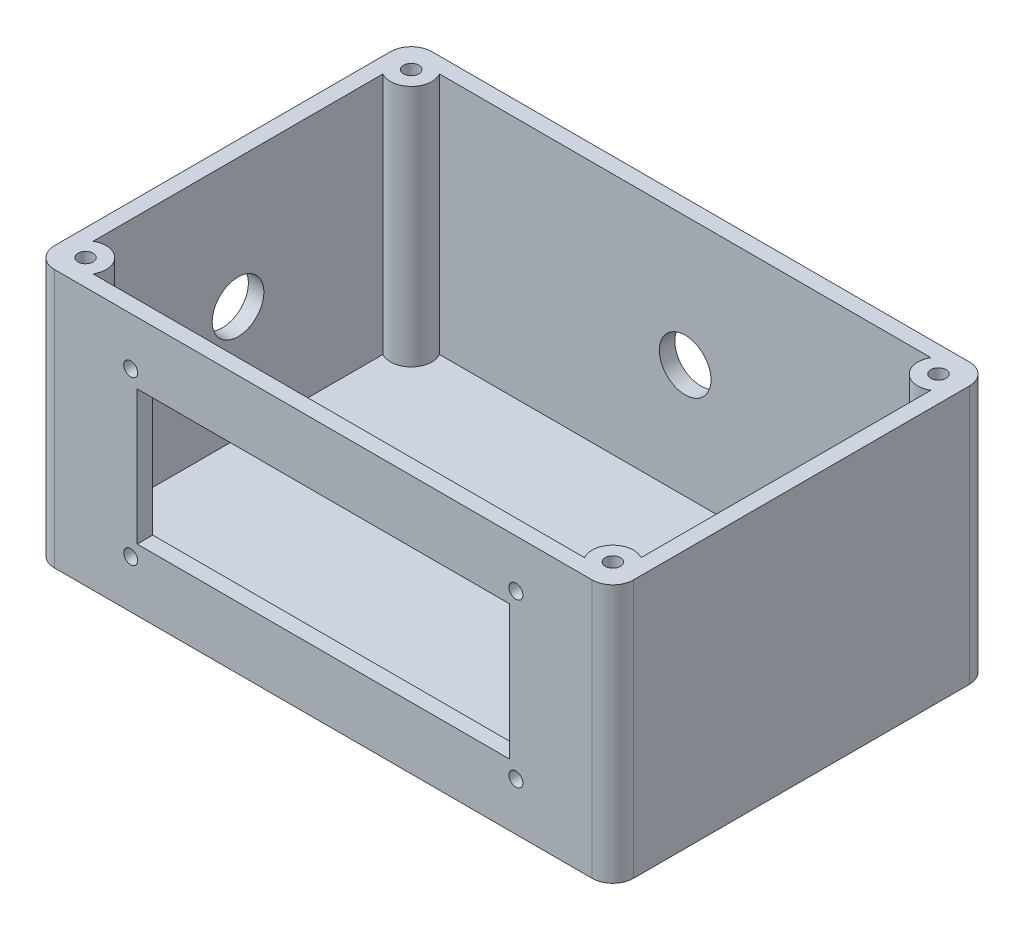
ISO-10303-21;
HEADER;
FILE_DESCRIPTION(('STEP AP214'),'2;1');
FILE_NAME('part.step','',(''),(''),'','','');
FILE_SCHEMA(('AUTOMOTIVE_DESIGN { 1 0 10303 214 1 1 1 1 }'));
ENDSEC;
DATA;
#1=APPLICATION_CONTEXT('core data for automotive mechanical design processes');
#2=APPLICATION_PROTOCOL_DEFINITION('international standard','automotive_design',2000,#1);
#3=PRODUCT_CONTEXT('',#1,'mechanical');
#4=PRODUCT('Part','Part','',(#3));
#5=PRODUCT_RELATED_PRODUCT_CATEGORY('part','',(#4));
#6=PRODUCT_DEFINITION_FORMATION('','',#4);
#7=PRODUCT_DEFINITION_CONTEXT('part definition',#1,'design');
#8=PRODUCT_DEFINITION('design','',#6,#7);
#9=PRODUCT_DEFINITION_SHAPE('','',#8);
#10=(LENGTH_UNIT() NAMED_UNIT(*) SI_UNIT(.MILLI.,.METRE.));
#11=(NAMED_UNIT(*) PLANE_ANGLE_UNIT() SI_UNIT($,.RADIAN.));
#12=(NAMED_UNIT(*) SI_UNIT($,.STERADIAN.) SOLID_ANGLE_UNIT());
#13=UNCERTAINTY_MEASURE_WITH_UNIT(LENGTH_MEASURE(1.E-05),#10,'distance_accuracy_value','');
#14=(GEOMETRIC_REPRESENTATION_CONTEXT(3) GLOBAL_UNCERTAINTY_ASSIGNED_CONTEXT((#13)) GLOBAL_UNIT_ASSIGNED_CONTEXT((#10,
#11,#12)) REPRESENTATION_CONTEXT('',''));
#15=CARTESIAN_POINT('',(0.,0.,0.));
#16=DIRECTION('',(0.,0.,1.));
#17=DIRECTION('',(1.,0.,0.));
#18=AXIS2_PLACEMENT_3D('',#15,#16,#17);
#19=CARTESIAN_POINT('',(53.,50.,-36.5));
#20=DIRECTION('',(-1.,0.,0.));
#21=DIRECTION('',(0.,0.,1.));
#22=AXIS2_PLACEMENT_3D('',#19,#20,#21);
#23=PLANE('',#22);
#24=DIRECTION('',(0.,0.,-1.));
#25=VECTOR('',#24,1.);
#26=CARTESIAN_POINT('',(53.,3.,-36.5));
#27=LINE('',#26,#25);
#28=CARTESIAN_POINT('',(53.,3.,28.0358983848622));
#29=VERTEX_POINT('',#28);
#30=CARTESIAN_POINT('',(53.,3.,-28.0358983848623));
#31=VERTEX_POINT('',#30);
#32=EDGE_CURVE('E278',#29,#31,#27,.T.);
#33=ORIENTED_EDGE('',*,*,#32,.F.);
#34=DIRECTION('',(0.,-1.,0.));
#35=VECTOR('',#34,1.);
#36=CARTESIAN_POINT('',(53.,50.,28.0358983848622));
#37=LINE('',#36,#35);
#38=CARTESIAN_POINT('',(53.,50.,28.0358983848622));
#39=VERTEX_POINT('',#38);
#40=EDGE_CURVE('E238',#29,#39,#37,.F.);
#41=ORIENTED_EDGE('',*,*,#40,.T.);
#42=DIRECTION('',(0.,0.,-1.));
#43=VECTOR('',#42,1.);
#44=CARTESIAN_POINT('',(53.,50.,-36.5));
#45=LINE('',#44,#43);
#46=CARTESIAN_POINT('',(53.,50.,-28.0358983848623));
#47=VERTEX_POINT('',#46);
#48=EDGE_CURVE('E292',#39,#47,#45,.T.);
#49=ORIENTED_EDGE('',*,*,#48,.T.);
#50=DIRECTION('',(0.,-1.,0.));
#51=VECTOR('',#50,1.);
#52=CARTESIAN_POINT('',(53.,50.,-28.0358983848623));
#53=LINE('',#52,#51);
#54=EDGE_CURVE('E246',#47,#31,#53,.T.);
#55=ORIENTED_EDGE('',*,*,#54,.T.);
#56=EDGE_LOOP('',(#33,#41,#49,#55));
#57=FACE_BOUND('',#56,.T.);
#58=ADVANCED_FACE('F38',(#57),#23,.T.);
#59=CARTESIAN_POINT('',(-56.,50.,33.5));
#60=DIRECTION('',(0.,0.,-1.));
#61=DIRECTION('',(-1.,0.,0.));
#62=AXIS2_PLACEMENT_3D('',#59,#60,#61);
#63=PLANE('',#62);
#64=CARTESIAN_POINT('',(-37.26,9.26000000000001,33.5));
#65=DIRECTION('',(0.,0.,-1.));
#66=DIRECTION('',(-1.,0.,0.));
#67=AXIS2_PLACEMENT_3D('',#64,#65,#66);
#68=CIRCLE('',#67,1.35);
#69=CARTESIAN_POINT('',(-38.61,9.26000000000001,33.5));
#70=VERTEX_POINT('',#69);
#71=EDGE_CURVE('E804',#70,#70,#68,.F.);
#72=ORIENTED_EDGE('',*,*,#71,.T.);
#73=EDGE_LOOP('',(#72));
#74=FACE_BOUND('',#73,.T.);
#75=CARTESIAN_POINT('',(37.26,40.74,33.5));
#76=DIRECTION('',(0.,0.,-1.));
#77=DIRECTION('',(-1.,0.,0.));
#78=AXIS2_PLACEMENT_3D('',#75,#76,#77);
#79=CIRCLE('',#78,1.35);
#80=CARTESIAN_POINT('',(35.91,40.74,33.5));
#81=VERTEX_POINT('',#80);
#82=EDGE_CURVE('E803',#81,#81,#79,.F.);
#83=ORIENTED_EDGE('',*,*,#82,.T.);
#84=EDGE_LOOP('',(#83));
#85=FACE_BOUND('',#84,.T.);
#86=CARTESIAN_POINT('',(37.26,9.26000000000001,33.5));
#87=DIRECTION('',(0.,0.,-1.));
#88=DIRECTION('',(-1.,0.,0.));
#89=AXIS2_PLACEMENT_3D('',#86,#87,#88);
#90=CIRCLE('',#89,1.35);
#91=CARTESIAN_POINT('',(35.91,9.26000000000001,33.5));
#92=VERTEX_POINT('',#91);
#93=EDGE_CURVE('E794',#92,#92,#90,.F.);
#94=ORIENTED_EDGE('',*,*,#93,.T.);
#95=EDGE_LOOP('',(#94));
#96=FACE_BOUND('',#95,.T.);
#97=CARTESIAN_POINT('',(-37.26,40.74,33.5));
#98=DIRECTION('',(0.,0.,-1.));
#99=DIRECTION('',(-1.,0.,0.));
#100=AXIS2_PLACEMENT_3D('',#97,#98,#99);
#101=CIRCLE('',#100,1.35);
#102=CARTESIAN_POINT('',(-38.61,40.74,33.5));
#103=VERTEX_POINT('',#102);
#104=EDGE_CURVE('E813',#103,#103,#101,.F.);
#105=ORIENTED_EDGE('',*,*,#104,.T.);
#106=EDGE_LOOP('',(#105));
#107=FACE_BOUND('',#106,.T.);
#108=DIRECTION('',(0.,1.,0.));
#109=VECTOR('',#108,1.);
#110=CARTESIAN_POINT('',(36.,38.,33.5));
#111=LINE('',#110,#109);
#112=CARTESIAN_POINT('',(36.,12.,33.5));
#113=VERTEX_POINT('',#112);
#114=CARTESIAN_POINT('',(36.,38.,33.5));
#115=VERTEX_POINT('',#114);
#116=EDGE_CURVE('E185',#113,#115,#111,.T.);
#117=ORIENTED_EDGE('',*,*,#116,.T.);
#118=DIRECTION('',(-1.,0.,0.));
#119=VECTOR('',#118,1.);
#120=CARTESIAN_POINT('',(-36.,38.,33.5));
#121=LINE('',#120,#119);
#122=CARTESIAN_POINT('',(-36.,38.,33.5));
#123=VERTEX_POINT('',#122);
#124=EDGE_CURVE('E214',#115,#123,#121,.T.);
#125=ORIENTED_EDGE('',*,*,#124,.T.);
#126=DIRECTION('',(0.,-1.,0.));
#127=VECTOR('',#126,1.);
#128=CARTESIAN_POINT('',(-36.,38.,33.5));
#129=LINE('',#128,#127);
#130=CARTESIAN_POINT('',(-36.,12.,33.5));
#131=VERTEX_POINT('',#130);
#132=EDGE_CURVE('E189',#123,#131,#129,.T.);
#133=ORIENTED_EDGE('',*,*,#132,.T.);
#134=DIRECTION('',(1.,0.,0.));
#135=VECTOR('',#134,1.);
#136=CARTESIAN_POINT('',(-36.,12.,33.5));
#137=LINE('',#136,#135);
#138=EDGE_CURVE('E190',#131,#113,#137,.T.);
#139=ORIENTED_EDGE('',*,*,#138,.T.);
#140=EDGE_LOOP('',(#117,#125,#133,#139));
#141=FACE_BOUND('',#140,.T.);
#142=DIRECTION('',(1.,0.,0.));
#143=VECTOR('',#142,1.);
#144=CARTESIAN_POINT('',(-56.,50.,33.5));
#145=LINE('',#144,#143);
#146=CARTESIAN_POINT('',(-47.5358983848623,50.,33.5));
#147=VERTEX_POINT('',#146);
#148=CARTESIAN_POINT('',(47.5358983848623,50.,33.5));
#149=VERTEX_POINT('',#148);
#150=EDGE_CURVE('E302',#147,#149,#145,.T.);
#151=ORIENTED_EDGE('',*,*,#150,.T.);
#152=DIRECTION('',(0.,-1.,0.));
#153=VECTOR('',#152,1.);
#154=CARTESIAN_POINT('',(47.5358983848623,50.,33.5));
#155=LINE('',#154,#153);
#156=CARTESIAN_POINT('',(47.5358983848623,3.,33.5));
#157=VERTEX_POINT('',#156);
#158=EDGE_CURVE('E234',#149,#157,#155,.T.);
#159=ORIENTED_EDGE('',*,*,#158,.T.);
#160=DIRECTION('',(1.,0.,0.));
#161=VECTOR('',#160,1.);
#162=CARTESIAN_POINT('',(-56.,3.,33.5));
#163=LINE('',#162,#161);
#164=CARTESIAN_POINT('',(-47.5358983848623,3.,33.5));
#165=VERTEX_POINT('',#164);
#166=EDGE_CURVE('E288',#165,#157,#163,.T.);
#167=ORIENTED_EDGE('',*,*,#166,.F.);
#168=DIRECTION('',(0.,-1.,0.));
#169=VECTOR('',#168,1.);
#170=CARTESIAN_POINT('',(-47.5358983848623,50.,33.5));
#171=LINE('',#170,#169);
#172=EDGE_CURVE('E258',#165,#147,#171,.F.);
#173=ORIENTED_EDGE('',*,*,#172,.T.);
#174=EDGE_LOOP('',(#151,#159,#167,#173));
#175=FACE_BOUND('',#174,.T.);
#176=ADVANCED_FACE('F435',(#74,#85,#96,#107,#141,#175),#63,.T.);
#177=CARTESIAN_POINT('',(-56.,50.,-33.5));
#178=DIRECTION('',(0.,0.,1.));
#179=DIRECTION('',(1.,0.,0.));
#180=AXIS2_PLACEMENT_3D('',#177,#178,#179);
#181=PLANE('',#180);
#182=CARTESIAN_POINT('',(0.,25.,-33.5));
#183=DIRECTION('',(0.,0.,1.));
#184=DIRECTION('',(1.,0.,0.));
#185=AXIS2_PLACEMENT_3D('',#182,#183,#184);
#186=CIRCLE('',#185,5.);
#187=CARTESIAN_POINT('',(5.,25.,-33.5));
#188=VERTEX_POINT('',#187);
#189=EDGE_CURVE('E783',#188,#188,#186,.F.);
#190=ORIENTED_EDGE('',*,*,#189,.T.);
#191=EDGE_LOOP('',(#190));
#192=FACE_BOUND('',#191,.T.);
#193=DIRECTION('',(-1.,0.,0.));
#194=VECTOR('',#193,1.);
#195=CARTESIAN_POINT('',(-56.,3.,-33.5));
#196=LINE('',#195,#194);
#197=CARTESIAN_POINT('',(47.5358983848622,3.,-33.5));
#198=VERTEX_POINT('',#197);
#199=CARTESIAN_POINT('',(-47.5358983848623,3.,-33.5));
#200=VERTEX_POINT('',#199);
#201=EDGE_CURVE('E281',#198,#200,#196,.T.);
#202=ORIENTED_EDGE('',*,*,#201,.F.);
#203=DIRECTION('',(0.,-1.,0.));
#204=VECTOR('',#203,1.);
#205=CARTESIAN_POINT('',(47.5358983848622,50.,-33.5));
#206=LINE('',#205,#204);
#207=CARTESIAN_POINT('',(47.5358983848622,50.,-33.5));
#208=VERTEX_POINT('',#207);
#209=EDGE_CURVE('E250',#198,#208,#206,.F.);
#210=ORIENTED_EDGE('',*,*,#209,.T.);
#211=DIRECTION('',(-1.,0.,0.));
#212=VECTOR('',#211,1.);
#213=CARTESIAN_POINT('',(-56.,50.,-33.5));
#214=LINE('',#213,#212);
#215=CARTESIAN_POINT('',(-47.5358983848623,50.,-33.5));
#216=VERTEX_POINT('',#215);
#217=EDGE_CURVE('E295',#208,#216,#214,.T.);
#218=ORIENTED_EDGE('',*,*,#217,.T.);
#219=DIRECTION('',(0.,-1.,0.));
#220=VECTOR('',#219,1.);
#221=CARTESIAN_POINT('',(-47.5358983848623,50.,-33.5));
#222=LINE('',#221,#220);
#223=EDGE_CURVE('E274',#216,#200,#222,.T.);
#224=ORIENTED_EDGE('',*,*,#223,.T.);
#225=EDGE_LOOP('',(#202,#210,#218,#224));
#226=FACE_BOUND('',#225,.T.);
#227=ADVANCED_FACE('F441',(#192,#226),#181,.T.);
#228=CARTESIAN_POINT('',(-53.,50.,-36.5));
#229=DIRECTION('',(1.,0.,0.));
#230=DIRECTION('',(0.,0.,-1.));
#231=AXIS2_PLACEMENT_3D('',#228,#229,#230);
#232=PLANE('',#231);
#233=CARTESIAN_POINT('',(-53.,25.,0.));
#234=DIRECTION('',(1.,0.,0.));
#235=DIRECTION('',(0.,0.,-1.));
#236=AXIS2_PLACEMENT_3D('',#233,#234,#235);
#237=CIRCLE('',#236,5.);
#238=CARTESIAN_POINT('',(-53.,25.,-4.99999999999999));
#239=VERTEX_POINT('',#238);
#240=EDGE_CURVE('E778',#239,#239,#237,.F.);
#241=ORIENTED_EDGE('',*,*,#240,.T.);
#242=EDGE_LOOP('',(#241));
#243=FACE_BOUND('',#242,.T.);
#244=DIRECTION('',(0.,0.,1.));
#245=VECTOR('',#244,1.);
#246=CARTESIAN_POINT('',(-53.,50.,-36.5));
#247=LINE('',#246,#245);
#248=CARTESIAN_POINT('',(-53.,50.,-28.0358983848622));
#249=VERTEX_POINT('',#248);
#250=CARTESIAN_POINT('',(-53.,50.,28.0358983848622));
#251=VERTEX_POINT('',#250);
#252=EDGE_CURVE('E298',#249,#251,#247,.T.);
#253=ORIENTED_EDGE('',*,*,#252,.T.);
#254=DIRECTION('',(0.,-1.,0.));
#255=VECTOR('',#254,1.);
#256=CARTESIAN_POINT('',(-53.,50.,28.0358983848622));
#257=LINE('',#256,#255);
#258=CARTESIAN_POINT('',(-53.,3.,28.0358983848622));
#259=VERTEX_POINT('',#258);
#260=EDGE_CURVE('E262',#251,#259,#257,.T.);
#261=ORIENTED_EDGE('',*,*,#260,.T.);
#262=DIRECTION('',(0.,0.,1.));
#263=VECTOR('',#262,1.);
#264=CARTESIAN_POINT('',(-53.,3.,-36.5));
#265=LINE('',#264,#263);
#266=CARTESIAN_POINT('',(-53.,3.,-28.0358983848622));
#267=VERTEX_POINT('',#266);
#268=EDGE_CURVE('E284',#267,#259,#265,.T.);
#269=ORIENTED_EDGE('',*,*,#268,.F.);
#270=DIRECTION('',(0.,-1.,0.));
#271=VECTOR('',#270,1.);
#272=CARTESIAN_POINT('',(-53.,50.,-28.0358983848622));
#273=LINE('',#272,#271);
#274=EDGE_CURVE('E270',#267,#249,#273,.F.);
#275=ORIENTED_EDGE('',*,*,#274,.T.);
#276=EDGE_LOOP('',(#253,#261,#269,#275));
#277=FACE_BOUND('',#276,.T.);
#278=ADVANCED_FACE('F451',(#243,#277),#232,.T.);
#279=CARTESIAN_POINT('',(56.,50.,-36.5));
#280=DIRECTION('',(-1.,0.,0.));
#281=DIRECTION('',(0.,0.,1.));
#282=AXIS2_PLACEMENT_3D('',#279,#280,#281);
#283=PLANE('',#282);
#284=DIRECTION('',(0.,0.,-1.));
#285=VECTOR('',#284,1.);
#286=CARTESIAN_POINT('',(56.,50.,-36.5));
#287=LINE('',#286,#285);
#288=CARTESIAN_POINT('',(56.,50.,32.5));
#289=VERTEX_POINT('',#288);
#290=CARTESIAN_POINT('',(56.,50.,-32.5));
#291=VERTEX_POINT('',#290);
#292=EDGE_CURVE('E307',#289,#291,#287,.T.);
#293=ORIENTED_EDGE('',*,*,#292,.F.);
#294=DIRECTION('',(0.,-1.,0.));
#295=VECTOR('',#294,1.);
#296=CARTESIAN_POINT('',(56.,50.,32.5));
#297=LINE('',#296,#295);
#298=CARTESIAN_POINT('',(56.,0.,32.5));
#299=VERTEX_POINT('',#298);
#300=EDGE_CURVE('E11',#289,#299,#297,.T.);
#301=ORIENTED_EDGE('',*,*,#300,.T.);
#302=DIRECTION('',(0.,0.,-1.));
#303=VECTOR('',#302,1.);
#304=CARTESIAN_POINT('',(56.,0.,-36.5));
#305=LINE('',#304,#303);
#306=CARTESIAN_POINT('',(56.,0.,-32.5));
#307=VERTEX_POINT('',#306);
#308=EDGE_CURVE('E306',#299,#307,#305,.T.);
#309=ORIENTED_EDGE('',*,*,#308,.T.);
#310=DIRECTION('',(0.,-1.,0.));
#311=VECTOR('',#310,1.);
#312=CARTESIAN_POINT('',(56.,50.,-32.5));
#313=LINE('',#312,#311);
#314=EDGE_CURVE('E47',#307,#291,#313,.F.);
#315=ORIENTED_EDGE('',*,*,#314,.T.);
#316=EDGE_LOOP('',(#293,#301,#309,#315));
#317=FACE_BOUND('',#316,.T.);
#318=ADVANCED_FACE('F397',(#317),#283,.F.);
#319=CARTESIAN_POINT('',(-56.,50.,-36.5));
#320=DIRECTION('',(0.,0.,1.));
#321=DIRECTION('',(1.,0.,0.));
#322=AXIS2_PLACEMENT_3D('',#319,#320,#321);
#323=PLANE('',#322);
#324=CARTESIAN_POINT('',(0.,25.,-36.5));
#325=DIRECTION('',(0.,0.,-1.));
#326=DIRECTION('',(-1.,0.,0.));
#327=AXIS2_PLACEMENT_3D('',#324,#325,#326);
#328=CIRCLE('',#327,5.);
#329=CARTESIAN_POINT('',(-5.,25.,-36.5));
#330=VERTEX_POINT('',#329);
#331=EDGE_CURVE('E788',#330,#330,#328,.T.);
#332=ORIENTED_EDGE('',*,*,#331,.F.);
#333=EDGE_LOOP('',(#332));
#334=FACE_BOUND('',#333,.T.);
#335=DIRECTION('',(-1.,0.,0.));
#336=VECTOR('',#335,1.);
#337=CARTESIAN_POINT('',(-56.,0.,-36.5));
#338=LINE('',#337,#336);
#339=CARTESIAN_POINT('',(52.,0.,-36.5));
#340=VERTEX_POINT('',#339);
#341=CARTESIAN_POINT('',(-52.,0.,-36.5));
#342=VERTEX_POINT('',#341);
#343=EDGE_CURVE('E326',#340,#342,#338,.T.);
#344=ORIENTED_EDGE('',*,*,#343,.T.);
#345=DIRECTION('',(0.,-1.,0.));
#346=VECTOR('',#345,1.);
#347=CARTESIAN_POINT('',(-52.,50.,-36.5));
#348=LINE('',#347,#346);
#349=CARTESIAN_POINT('',(-52.,50.,-36.5));
#350=VERTEX_POINT('',#349);
#351=EDGE_CURVE('E374',#342,#350,#348,.F.);
#352=ORIENTED_EDGE('',*,*,#351,.T.);
#353=DIRECTION('',(-1.,0.,0.));
#354=VECTOR('',#353,1.);
#355=CARTESIAN_POINT('',(-56.,50.,-36.5));
#356=LINE('',#355,#354);
#357=CARTESIAN_POINT('',(52.,50.,-36.5));
#358=VERTEX_POINT('',#357);
#359=EDGE_CURVE('E311',#358,#350,#356,.T.);
#360=ORIENTED_EDGE('',*,*,#359,.F.);
#361=DIRECTION('',(0.,-1.,0.));
#362=VECTOR('',#361,1.);
#363=CARTESIAN_POINT('',(52.,50.,-36.5));
#364=LINE('',#363,#362);
#365=EDGE_CURVE('E370',#358,#340,#364,.T.);
#366=ORIENTED_EDGE('',*,*,#365,.T.);
#367=EDGE_LOOP('',(#344,#352,#360,#366));
#368=FACE_BOUND('',#367,.T.);
#369=ADVANCED_FACE('F408',(#334,#368),#323,.F.);
#370=CARTESIAN_POINT('',(-56.,50.,-36.5));
#371=DIRECTION('',(1.,0.,0.));
#372=DIRECTION('',(0.,0.,-1.));
#373=AXIS2_PLACEMENT_3D('',#370,#371,#372);
#374=PLANE('',#373);
#375=CARTESIAN_POINT('',(-56.,25.,0.));
#376=DIRECTION('',(-1.,0.,0.));
#377=DIRECTION('',(0.,0.,1.));
#378=AXIS2_PLACEMENT_3D('',#375,#376,#377);
#379=CIRCLE('',#378,5.);
#380=CARTESIAN_POINT('',(-56.,25.,5.00000000000001));
#381=VERTEX_POINT('',#380);
#382=EDGE_CURVE('E781',#381,#381,#379,.T.);
#383=ORIENTED_EDGE('',*,*,#382,.F.);
#384=EDGE_LOOP('',(#383));
#385=FACE_BOUND('',#384,.T.);
#386=DIRECTION('',(0.,0.,1.));
#387=VECTOR('',#386,1.);
#388=CARTESIAN_POINT('',(-56.,50.,-36.5));
#389=LINE('',#388,#387);
#390=CARTESIAN_POINT('',(-56.,50.,-32.5));
#391=VERTEX_POINT('',#390);
#392=CARTESIAN_POINT('',(-56.,50.,32.5));
#393=VERTEX_POINT('',#392);
#394=EDGE_CURVE('E316',#391,#393,#389,.T.);
#395=ORIENTED_EDGE('',*,*,#394,.F.);
#396=DIRECTION('',(0.,-1.,0.));
#397=VECTOR('',#396,1.);
#398=CARTESIAN_POINT('',(-56.,50.,-32.5));
#399=LINE('',#398,#397);
#400=CARTESIAN_POINT('',(-56.,0.,-32.5));
#401=VERTEX_POINT('',#400);
#402=EDGE_CURVE('E354',#391,#401,#399,.T.);
#403=ORIENTED_EDGE('',*,*,#402,.T.);
#404=DIRECTION('',(0.,0.,1.));
#405=VECTOR('',#404,1.);
#406=CARTESIAN_POINT('',(-56.,0.,-36.5));
#407=LINE('',#406,#405);
#408=CARTESIAN_POINT('',(-56.,0.,32.5));
#409=VERTEX_POINT('',#408);
#410=EDGE_CURVE('E330',#401,#409,#407,.T.);
#411=ORIENTED_EDGE('',*,*,#410,.T.);
#412=DIRECTION('',(0.,-1.,0.));
#413=VECTOR('',#412,1.);
#414=CARTESIAN_POINT('',(-56.,50.,32.5));
#415=LINE('',#414,#413);
#416=EDGE_CURVE('E351',#409,#393,#415,.F.);
#417=ORIENTED_EDGE('',*,*,#416,.T.);
#418=EDGE_LOOP('',(#395,#403,#411,#417));
#419=FACE_BOUND('',#418,.T.);
#420=ADVANCED_FACE('F419',(#385,#419),#374,.F.);
#421=CARTESIAN_POINT('',(-56.,50.,36.5));
#422=DIRECTION('',(0.,0.,-1.));
#423=DIRECTION('',(-1.,0.,0.));
#424=AXIS2_PLACEMENT_3D('',#421,#422,#423);
#425=PLANE('',#424);
#426=CARTESIAN_POINT('',(-37.26,9.26000000000001,36.5));
#427=DIRECTION('',(0.,0.,1.));
#428=DIRECTION('',(-1.,0.,0.));
#429=AXIS2_PLACEMENT_3D('',#426,#427,#428);
#430=CIRCLE('',#429,1.35);
#431=CARTESIAN_POINT('',(-38.61,9.26000000000001,36.5));
#432=VERTEX_POINT('',#431);
#433=EDGE_CURVE('E808',#432,#432,#430,.T.);
#434=ORIENTED_EDGE('',*,*,#433,.F.);
#435=EDGE_LOOP('',(#434));
#436=FACE_BOUND('',#435,.T.);
#437=CARTESIAN_POINT('',(37.26,40.74,36.5));
#438=DIRECTION('',(0.,0.,1.));
#439=DIRECTION('',(-1.,0.,0.));
#440=AXIS2_PLACEMENT_3D('',#437,#438,#439);
#441=CIRCLE('',#440,1.35);
#442=CARTESIAN_POINT('',(35.91,40.74,36.5));
#443=VERTEX_POINT('',#442);
#444=EDGE_CURVE('E809',#443,#443,#441,.T.);
#445=ORIENTED_EDGE('',*,*,#444,.F.);
#446=EDGE_LOOP('',(#445));
#447=FACE_BOUND('',#446,.T.);
#448=CARTESIAN_POINT('',(37.26,9.26000000000001,36.5));
#449=DIRECTION('',(0.,0.,1.));
#450=DIRECTION('',(1.,0.,0.));
#451=AXIS2_PLACEMENT_3D('',#448,#449,#450);
#452=CIRCLE('',#451,1.35);
#453=CARTESIAN_POINT('',(38.61,9.26000000000001,36.5));
#454=VERTEX_POINT('',#453);
#455=EDGE_CURVE('E799',#454,#454,#452,.T.);
#456=ORIENTED_EDGE('',*,*,#455,.F.);
#457=EDGE_LOOP('',(#456));
#458=FACE_BOUND('',#457,.T.);
#459=CARTESIAN_POINT('',(-37.26,40.74,36.5));
#460=DIRECTION('',(0.,0.,1.));
#461=DIRECTION('',(1.,0.,0.));
#462=AXIS2_PLACEMENT_3D('',#459,#460,#461);
#463=CIRCLE('',#462,1.35);
#464=CARTESIAN_POINT('',(-35.91,40.74,36.5));
#465=VERTEX_POINT('',#464);
#466=EDGE_CURVE('E823',#465,#465,#463,.T.);
#467=ORIENTED_EDGE('',*,*,#466,.F.);
#468=EDGE_LOOP('',(#467));
#469=FACE_BOUND('',#468,.T.);
#470=DIRECTION('',(-1.,0.,0.));
#471=VECTOR('',#470,1.);
#472=CARTESIAN_POINT('',(-36.,38.,36.5));
#473=LINE('',#472,#471);
#474=CARTESIAN_POINT('',(36.,38.,36.5));
#475=VERTEX_POINT('',#474);
#476=CARTESIAN_POINT('',(-36.,38.,36.5));
#477=VERTEX_POINT('',#476);
#478=EDGE_CURVE('E207',#475,#477,#473,.T.);
#479=ORIENTED_EDGE('',*,*,#478,.F.);
#480=DIRECTION('',(0.,1.,0.));
#481=VECTOR('',#480,1.);
#482=CARTESIAN_POINT('',(36.,38.,36.5));
#483=LINE('',#482,#481);
#484=CARTESIAN_POINT('',(36.,12.,36.5));
#485=VERTEX_POINT('',#484);
#486=EDGE_CURVE('E182',#485,#475,#483,.T.);
#487=ORIENTED_EDGE('',*,*,#486,.F.);
#488=DIRECTION('',(1.,0.,0.));
#489=VECTOR('',#488,1.);
#490=CARTESIAN_POINT('',(-36.,12.,36.5));
#491=LINE('',#490,#489);
#492=CARTESIAN_POINT('',(-36.,12.,36.5));
#493=VERTEX_POINT('',#492);
#494=EDGE_CURVE('E193',#493,#485,#491,.T.);
#495=ORIENTED_EDGE('',*,*,#494,.F.);
#496=DIRECTION('',(0.,-1.,0.));
#497=VECTOR('',#496,1.);
#498=CARTESIAN_POINT('',(-36.,38.,36.5));
#499=LINE('',#498,#497);
#500=EDGE_CURVE('E202',#477,#493,#499,.T.);
#501=ORIENTED_EDGE('',*,*,#500,.F.);
#502=EDGE_LOOP('',(#479,#487,#495,#501));
#503=FACE_BOUND('',#502,.T.);
#504=DIRECTION('',(1.,0.,0.));
#505=VECTOR('',#504,1.);
#506=CARTESIAN_POINT('',(-56.,50.,36.5));
#507=LINE('',#506,#505);
#508=CARTESIAN_POINT('',(-52.,50.,36.5));
#509=VERTEX_POINT('',#508);
#510=CARTESIAN_POINT('',(52.,50.,36.5));
#511=VERTEX_POINT('',#510);
#512=EDGE_CURVE('E319',#509,#511,#507,.T.);
#513=ORIENTED_EDGE('',*,*,#512,.F.);
#514=DIRECTION('',(0.,-1.,0.));
#515=VECTOR('',#514,1.);
#516=CARTESIAN_POINT('',(-52.,50.,36.5));
#517=LINE('',#516,#515);
#518=CARTESIAN_POINT('',(-52.,0.,36.5));
#519=VERTEX_POINT('',#518);
#520=EDGE_CURVE('E390',#509,#519,#517,.T.);
#521=ORIENTED_EDGE('',*,*,#520,.T.);
#522=DIRECTION('',(1.,0.,0.));
#523=VECTOR('',#522,1.);
#524=CARTESIAN_POINT('',(-56.,0.,36.5));
#525=LINE('',#524,#523);
#526=CARTESIAN_POINT('',(52.,0.,36.5));
#527=VERTEX_POINT('',#526);
#528=EDGE_CURVE('E312',#519,#527,#525,.T.);
#529=ORIENTED_EDGE('',*,*,#528,.T.);
#530=DIRECTION('',(0.,-1.,0.));
#531=VECTOR('',#530,1.);
#532=CARTESIAN_POINT('',(52.,50.,36.5));
#533=LINE('',#532,#531);
#534=EDGE_CURVE('E54',#527,#511,#533,.F.);
#535=ORIENTED_EDGE('',*,*,#534,.T.);
#536=EDGE_LOOP('',(#513,#521,#529,#535));
#537=FACE_BOUND('',#536,.T.);
#538=ADVANCED_FACE('F205',(#436,#447,#458,#469,#503,#537),#425,.F.);
#539=CARTESIAN_POINT('',(0.,50.,0.));
#540=DIRECTION('',(0.,1.,0.));
#541=DIRECTION('',(0.,0.,1.));
#542=AXIS2_PLACEMENT_3D('',#539,#540,#541);
#543=PLANE('',#542);
#544=CARTESIAN_POINT('',(-51.,50.,-31.5));
#545=DIRECTION('',(0.,1.,0.));
#546=DIRECTION('',(0.,0.,-1.));
#547=AXIS2_PLACEMENT_3D('',#544,#545,#546);
#548=CIRCLE('',#547,1.47);
#549=CARTESIAN_POINT('',(-51.,50.,-32.97));
#550=VERTEX_POINT('',#549);
#551=EDGE_CURVE('E827',#550,#550,#548,.T.);
#552=ORIENTED_EDGE('',*,*,#551,.F.);
#553=EDGE_LOOP('',(#552));
#554=FACE_BOUND('',#553,.T.);
#555=CARTESIAN_POINT('',(-51.,50.,31.5));
#556=DIRECTION('',(0.,1.,0.));
#557=DIRECTION('',(0.,0.,1.));
#558=AXIS2_PLACEMENT_3D('',#555,#556,#557);
#559=CIRCLE('',#558,1.47000000000001);
#560=CARTESIAN_POINT('',(-51.,50.,32.97));
#561=VERTEX_POINT('',#560);
#562=EDGE_CURVE('E841',#561,#561,#559,.T.);
#563=ORIENTED_EDGE('',*,*,#562,.F.);
#564=EDGE_LOOP('',(#563));
#565=FACE_BOUND('',#564,.T.);
#566=CARTESIAN_POINT('',(51.,50.,31.4999999999999));
#567=DIRECTION('',(0.,1.,0.));
#568=DIRECTION('',(0.,0.,-1.));
#569=AXIS2_PLACEMENT_3D('',#566,#567,#568);
#570=CIRCLE('',#569,1.47000000000001);
#571=CARTESIAN_POINT('',(51.,50.,30.0299999999999));
#572=VERTEX_POINT('',#571);
#573=EDGE_CURVE('E833',#572,#572,#570,.T.);
#574=ORIENTED_EDGE('',*,*,#573,.F.);
#575=EDGE_LOOP('',(#574));
#576=FACE_BOUND('',#575,.T.);
#577=CARTESIAN_POINT('',(51.,50.,-31.5));
#578=DIRECTION('',(0.,1.,0.));
#579=DIRECTION('',(0.,0.,1.));
#580=AXIS2_PLACEMENT_3D('',#577,#578,#579);
#581=CIRCLE('',#580,1.47);
#582=CARTESIAN_POINT('',(51.,50.,-30.03));
#583=VERTEX_POINT('',#582);
#584=EDGE_CURVE('E832',#583,#583,#581,.T.);
#585=ORIENTED_EDGE('',*,*,#584,.F.);
#586=EDGE_LOOP('',(#585));
#587=FACE_BOUND('',#586,.T.);
#588=ORIENTED_EDGE('',*,*,#48,.F.);
#589=CARTESIAN_POINT('',(51.,50.,31.5));
#590=DIRECTION('',(0.,1.,0.));
#591=DIRECTION('',(0.,0.,1.));
#592=AXIS2_PLACEMENT_3D('',#589,#590,#591);
#593=CIRCLE('',#592,4.);
#594=EDGE_CURVE('E201',#39,#149,#593,.T.);
#595=ORIENTED_EDGE('',*,*,#594,.T.);
#596=ORIENTED_EDGE('',*,*,#150,.F.);
#597=CARTESIAN_POINT('',(-51.,50.,31.5));
#598=DIRECTION('',(0.,1.,0.));
#599=DIRECTION('',(0.,0.,-1.));
#600=AXIS2_PLACEMENT_3D('',#597,#598,#599);
#601=CIRCLE('',#600,4.);
#602=EDGE_CURVE('E254',#147,#251,#601,.T.);
#603=ORIENTED_EDGE('',*,*,#602,.T.);
#604=ORIENTED_EDGE('',*,*,#252,.F.);
#605=CARTESIAN_POINT('',(-51.,50.,-31.5));
#606=DIRECTION('',(0.,1.,0.));
#607=DIRECTION('',(0.,0.,1.));
#608=AXIS2_PLACEMENT_3D('',#605,#606,#607);
#609=CIRCLE('',#608,4.00000000000001);
#610=EDGE_CURVE('E266',#249,#216,#609,.T.);
#611=ORIENTED_EDGE('',*,*,#610,.T.);
#612=ORIENTED_EDGE('',*,*,#217,.F.);
#613=CARTESIAN_POINT('',(51.,50.,-31.5));
#614=DIRECTION('',(0.,1.,0.));
#615=DIRECTION('',(0.,0.,-1.));
#616=AXIS2_PLACEMENT_3D('',#613,#614,#615);
#617=CIRCLE('',#616,4.00000000000001);
#618=EDGE_CURVE('E242',#208,#47,#617,.T.);
#619=ORIENTED_EDGE('',*,*,#618,.T.);
#620=EDGE_LOOP('',(#588,#595,#596,#603,#604,#611,#612,#619));
#621=FACE_BOUND('',#620,.T.);
#622=ORIENTED_EDGE('',*,*,#359,.T.);
#623=CARTESIAN_POINT('',(-52.,50.,-32.5));
#624=DIRECTION('',(0.,1.,0.));
#625=DIRECTION('',(0.,0.,1.));
#626=AXIS2_PLACEMENT_3D('',#623,#624,#625);
#627=CIRCLE('',#626,4.);
#628=EDGE_CURVE('E385',#350,#391,#627,.T.);
#629=ORIENTED_EDGE('',*,*,#628,.T.);
#630=ORIENTED_EDGE('',*,*,#394,.T.);
#631=CARTESIAN_POINT('',(-52.,50.,32.5));
#632=DIRECTION('',(0.,1.,0.));
#633=DIRECTION('',(0.,0.,1.));
#634=AXIS2_PLACEMENT_3D('',#631,#632,#633);
#635=CIRCLE('',#634,4.);
#636=EDGE_CURVE('E61',#393,#509,#635,.T.);
#637=ORIENTED_EDGE('',*,*,#636,.T.);
#638=ORIENTED_EDGE('',*,*,#512,.T.);
#639=CARTESIAN_POINT('',(52.,50.,32.5));
#640=DIRECTION('',(0.,1.,0.));
#641=DIRECTION('',(0.,0.,1.));
#642=AXIS2_PLACEMENT_3D('',#639,#640,#641);
#643=CIRCLE('',#642,4.);
#644=EDGE_CURVE('E380',#511,#289,#643,.T.);
#645=ORIENTED_EDGE('',*,*,#644,.T.);
#646=ORIENTED_EDGE('',*,*,#292,.T.);
#647=CARTESIAN_POINT('',(52.,50.,-32.5));
#648=DIRECTION('',(0.,1.,0.));
#649=DIRECTION('',(0.,0.,1.));
#650=AXIS2_PLACEMENT_3D('',#647,#648,#649);
#651=CIRCLE('',#650,4.);
#652=EDGE_CURVE('E377',#291,#358,#651,.T.);
#653=ORIENTED_EDGE('',*,*,#652,.T.);
#654=EDGE_LOOP('',(#622,#629,#630,#637,#638,#645,#646,#653));
#655=FACE_BOUND('',#654,.T.);
#656=ADVANCED_FACE('F402',(#554,#565,#576,#587,#621,#655),#543,.T.);
#657=CARTESIAN_POINT('',(0.,0.,0.));
#658=DIRECTION('',(0.,1.,0.));
#659=DIRECTION('',(0.,0.,1.));
#660=AXIS2_PLACEMENT_3D('',#657,#658,#659);
#661=PLANE('',#660);
#662=ORIENTED_EDGE('',*,*,#410,.F.);
#663=CARTESIAN_POINT('',(-52.,0.,-32.5));
#664=DIRECTION('',(0.,1.,0.));
#665=DIRECTION('',(0.,0.,1.));
#666=AXIS2_PLACEMENT_3D('',#663,#664,#665);
#667=CIRCLE('',#666,4.);
#668=EDGE_CURVE('E367',#401,#342,#667,.F.);
#669=ORIENTED_EDGE('',*,*,#668,.T.);
#670=ORIENTED_EDGE('',*,*,#343,.F.);
#671=CARTESIAN_POINT('',(52.,0.,-32.5));
#672=DIRECTION('',(0.,1.,0.));
#673=DIRECTION('',(0.,0.,1.));
#674=AXIS2_PLACEMENT_3D('',#671,#672,#673);
#675=CIRCLE('',#674,4.);
#676=EDGE_CURVE('E358',#340,#307,#675,.F.);
#677=ORIENTED_EDGE('',*,*,#676,.T.);
#678=ORIENTED_EDGE('',*,*,#308,.F.);
#679=CARTESIAN_POINT('',(52.,0.,32.5));
#680=DIRECTION('',(0.,1.,0.));
#681=DIRECTION('',(0.,0.,1.));
#682=AXIS2_PLACEMENT_3D('',#679,#680,#681);
#683=CIRCLE('',#682,4.);
#684=EDGE_CURVE('E361',#299,#527,#683,.F.);
#685=ORIENTED_EDGE('',*,*,#684,.T.);
#686=ORIENTED_EDGE('',*,*,#528,.F.);
#687=CARTESIAN_POINT('',(-52.,0.,32.5));
#688=DIRECTION('',(0.,1.,0.));
#689=DIRECTION('',(0.,0.,1.));
#690=AXIS2_PLACEMENT_3D('',#687,#688,#689);
#691=CIRCLE('',#690,4.);
#692=EDGE_CURVE('E364',#519,#409,#691,.F.);
#693=ORIENTED_EDGE('',*,*,#692,.T.);
#694=EDGE_LOOP('',(#662,#669,#670,#677,#678,#685,#686,#693));
#695=FACE_BOUND('',#694,.T.);
#696=ADVANCED_FACE('F412',(#695),#661,.F.);
#697=CARTESIAN_POINT('',(0.,3.,0.));
#698=DIRECTION('',(0.,1.,0.));
#699=DIRECTION('',(0.,0.,1.));
#700=AXIS2_PLACEMENT_3D('',#697,#698,#699);
#701=PLANE('',#700);
#702=ORIENTED_EDGE('',*,*,#166,.T.);
#703=CARTESIAN_POINT('',(51.,3.,31.5));
#704=DIRECTION('',(0.,1.,0.));
#705=DIRECTION('',(0.,0.,1.));
#706=AXIS2_PLACEMENT_3D('',#703,#704,#705);
#707=CIRCLE('',#706,4.);
#708=EDGE_CURVE('E347',#157,#29,#707,.F.);
#709=ORIENTED_EDGE('',*,*,#708,.T.);
#710=ORIENTED_EDGE('',*,*,#32,.T.);
#711=CARTESIAN_POINT('',(51.,3.,-31.5));
#712=DIRECTION('',(0.,1.,0.));
#713=DIRECTION('',(0.,0.,1.));
#714=AXIS2_PLACEMENT_3D('',#711,#712,#713);
#715=CIRCLE('',#714,4.00000000000001);
#716=EDGE_CURVE('E343',#31,#198,#715,.F.);
#717=ORIENTED_EDGE('',*,*,#716,.T.);
#718=ORIENTED_EDGE('',*,*,#201,.T.);
#719=CARTESIAN_POINT('',(-51.,3.,-31.5));
#720=DIRECTION('',(0.,1.,0.));
#721=DIRECTION('',(0.,0.,1.));
#722=AXIS2_PLACEMENT_3D('',#719,#720,#721);
#723=CIRCLE('',#722,4.00000000000001);
#724=EDGE_CURVE('E322',#200,#267,#723,.F.);
#725=ORIENTED_EDGE('',*,*,#724,.T.);
#726=ORIENTED_EDGE('',*,*,#268,.T.);
#727=CARTESIAN_POINT('',(-51.,3.,31.5));
#728=DIRECTION('',(0.,1.,0.));
#729=DIRECTION('',(0.,0.,1.));
#730=AXIS2_PLACEMENT_3D('',#727,#728,#729);
#731=CIRCLE('',#730,4.);
#732=EDGE_CURVE('E339',#259,#165,#731,.F.);
#733=ORIENTED_EDGE('',*,*,#732,.T.);
#734=EDGE_LOOP('',(#702,#709,#710,#717,#718,#725,#726,#733));
#735=FACE_BOUND('',#734,.T.);
#736=ADVANCED_FACE('F456',(#735),#701,.T.);
#737=CARTESIAN_POINT('',(-51.,50.,-31.5));
#738=DIRECTION('',(0.,-1.,0.));
#739=DIRECTION('',(0.,0.,-1.));
#740=AXIS2_PLACEMENT_3D('',#737,#738,#739);
#741=CYLINDRICAL_SURFACE('',#740,4.00000000000001);
#742=ORIENTED_EDGE('',*,*,#223,.F.);
#743=ORIENTED_EDGE('',*,*,#610,.F.);
#744=ORIENTED_EDGE('',*,*,#274,.F.);
#745=ORIENTED_EDGE('',*,*,#724,.F.);
#746=EDGE_LOOP('',(#742,#743,#744,#745));
#747=FACE_BOUND('',#746,.T.);
#748=ADVANCED_FACE('F447',(#747),#741,.T.);
#749=CARTESIAN_POINT('',(-51.,50.,31.5));
#750=DIRECTION('',(0.,-1.,0.));
#751=DIRECTION('',(0.,0.,-1.));
#752=AXIS2_PLACEMENT_3D('',#749,#750,#751);
#753=CYLINDRICAL_SURFACE('',#752,4.);
#754=ORIENTED_EDGE('',*,*,#260,.F.);
#755=ORIENTED_EDGE('',*,*,#602,.F.);
#756=ORIENTED_EDGE('',*,*,#172,.F.);
#757=ORIENTED_EDGE('',*,*,#732,.F.);
#758=EDGE_LOOP('',(#754,#755,#756,#757));
#759=FACE_BOUND('',#758,.T.);
#760=ADVANCED_FACE('F522',(#759),#753,.T.);
#761=CARTESIAN_POINT('',(51.,50.,-31.5));
#762=DIRECTION('',(0.,-1.,0.));
#763=DIRECTION('',(0.,0.,-1.));
#764=AXIS2_PLACEMENT_3D('',#761,#762,#763);
#765=CYLINDRICAL_SURFACE('',#764,4.00000000000001);
#766=ORIENTED_EDGE('',*,*,#209,.F.);
#767=ORIENTED_EDGE('',*,*,#716,.F.);
#768=ORIENTED_EDGE('',*,*,#54,.F.);
#769=ORIENTED_EDGE('',*,*,#618,.F.);
#770=EDGE_LOOP('',(#766,#767,#768,#769));
#771=FACE_BOUND('',#770,.T.);
#772=ADVANCED_FACE('F519',(#771),#765,.T.);
#773=CARTESIAN_POINT('',(51.,50.,31.5));
#774=DIRECTION('',(0.,-1.,0.));
#775=DIRECTION('',(0.,0.,-1.));
#776=AXIS2_PLACEMENT_3D('',#773,#774,#775);
#777=CYLINDRICAL_SURFACE('',#776,4.);
#778=ORIENTED_EDGE('',*,*,#40,.F.);
#779=ORIENTED_EDGE('',*,*,#708,.F.);
#780=ORIENTED_EDGE('',*,*,#158,.F.);
#781=ORIENTED_EDGE('',*,*,#594,.F.);
#782=EDGE_LOOP('',(#778,#779,#780,#781));
#783=FACE_BOUND('',#782,.T.);
#784=ADVANCED_FACE('F516',(#783),#777,.T.);
#785=CARTESIAN_POINT('',(36.,38.,-36.501));
#786=DIRECTION('',(1.,0.,0.));
#787=DIRECTION('',(0.,0.,-1.));
#788=AXIS2_PLACEMENT_3D('',#785,#786,#787);
#789=PLANE('',#788);
#790=DIRECTION('',(0.,0.,1.));
#791=VECTOR('',#790,1.);
#792=CARTESIAN_POINT('',(36.,12.,-36.501));
#793=LINE('',#792,#791);
#794=EDGE_CURVE('E177',#113,#485,#793,.T.);
#795=ORIENTED_EDGE('',*,*,#794,.T.);
#796=ORIENTED_EDGE('',*,*,#486,.T.);
#797=DIRECTION('',(0.,0.,1.));
#798=VECTOR('',#797,1.);
#799=CARTESIAN_POINT('',(36.,38.,-36.501));
#800=LINE('',#799,#798);
#801=EDGE_CURVE('E220',#115,#475,#800,.T.);
#802=ORIENTED_EDGE('',*,*,#801,.F.);
#803=ORIENTED_EDGE('',*,*,#116,.F.);
#804=EDGE_LOOP('',(#795,#796,#802,#803));
#805=FACE_BOUND('',#804,.T.);
#806=ADVANCED_FACE('F179',(#805),#789,.F.);
#807=CARTESIAN_POINT('',(-36.,12.,-36.501));
#808=DIRECTION('',(0.,-1.,0.));
#809=DIRECTION('',(0.,0.,-1.));
#810=AXIS2_PLACEMENT_3D('',#807,#808,#809);
#811=PLANE('',#810);
#812=DIRECTION('',(0.,0.,1.));
#813=VECTOR('',#812,1.);
#814=CARTESIAN_POINT('',(-36.,12.,-36.501));
#815=LINE('',#814,#813);
#816=EDGE_CURVE('E196',#131,#493,#815,.T.);
#817=ORIENTED_EDGE('',*,*,#816,.T.);
#818=ORIENTED_EDGE('',*,*,#494,.T.);
#819=ORIENTED_EDGE('',*,*,#794,.F.);
#820=ORIENTED_EDGE('',*,*,#138,.F.);
#821=EDGE_LOOP('',(#817,#818,#819,#820));
#822=FACE_BOUND('',#821,.T.);
#823=ADVANCED_FACE('F194',(#822),#811,.F.);
#824=CARTESIAN_POINT('',(-36.,38.,-36.501));
#825=DIRECTION('',(-1.,0.,0.));
#826=DIRECTION('',(0.,0.,1.));
#827=AXIS2_PLACEMENT_3D('',#824,#825,#826);
#828=PLANE('',#827);
#829=DIRECTION('',(0.,0.,1.));
#830=VECTOR('',#829,1.);
#831=CARTESIAN_POINT('',(-36.,38.,-36.501));
#832=LINE('',#831,#830);
#833=EDGE_CURVE('E209',#123,#477,#832,.T.);
#834=ORIENTED_EDGE('',*,*,#833,.T.);
#835=ORIENTED_EDGE('',*,*,#500,.T.);
#836=ORIENTED_EDGE('',*,*,#816,.F.);
#837=ORIENTED_EDGE('',*,*,#132,.F.);
#838=EDGE_LOOP('',(#834,#835,#836,#837));
#839=FACE_BOUND('',#838,.T.);
#840=ADVANCED_FACE('F507',(#839),#828,.F.);
#841=CARTESIAN_POINT('',(-36.,38.,-36.501));
#842=DIRECTION('',(0.,1.,0.));
#843=DIRECTION('',(0.,0.,1.));
#844=AXIS2_PLACEMENT_3D('',#841,#842,#843);
#845=PLANE('',#844);
#846=ORIENTED_EDGE('',*,*,#801,.T.);
#847=ORIENTED_EDGE('',*,*,#478,.T.);
#848=ORIENTED_EDGE('',*,*,#833,.F.);
#849=ORIENTED_EDGE('',*,*,#124,.F.);
#850=EDGE_LOOP('',(#846,#847,#848,#849));
#851=FACE_BOUND('',#850,.T.);
#852=ADVANCED_FACE('F503',(#851),#845,.F.);
#853=CARTESIAN_POINT('',(51.,40.,-31.5));
#854=DIRECTION('',(0.,1.,0.));
#855=DIRECTION('',(0.,0.,1.));
#856=AXIS2_PLACEMENT_3D('',#853,#854,#855);
#857=CYLINDRICAL_SURFACE('',#856,1.47);
#858=CARTESIAN_POINT('',(51.,40.,-31.5));
#859=DIRECTION('',(0.,1.,0.));
#860=DIRECTION('',(0.,0.,1.));
#861=AXIS2_PLACEMENT_3D('',#858,#859,#860);
#862=CIRCLE('',#861,1.47);
#863=CARTESIAN_POINT('',(51.,40.,-30.03));
#864=VERTEX_POINT('',#863);
#865=EDGE_CURVE('E221',#864,#864,#862,.T.);
#866=ORIENTED_EDGE('',*,*,#865,.F.);
#867=EDGE_LOOP('',(#866));
#868=FACE_BOUND('',#867,.T.);
#869=ORIENTED_EDGE('',*,*,#584,.T.);
#870=EDGE_LOOP('',(#869));
#871=FACE_BOUND('',#870,.T.);
#872=ADVANCED_FACE('F499',(#868,#871),#857,.F.);
#873=CARTESIAN_POINT('',(51.,40.,-31.5));
#874=DIRECTION('',(0.,1.,0.));
#875=DIRECTION('',(0.,0.,1.));
#876=AXIS2_PLACEMENT_3D('',#873,#874,#875);
#877=PLANE('',#876);
#878=ORIENTED_EDGE('',*,*,#865,.T.);
#879=EDGE_LOOP('',(#878));
#880=FACE_BOUND('',#879,.T.);
#881=ADVANCED_FACE('F495',(#880),#877,.T.);
#882=CARTESIAN_POINT('',(51.,40.,31.4999999999999));
#883=DIRECTION('',(0.,1.,0.));
#884=DIRECTION('',(0.,0.,1.));
#885=AXIS2_PLACEMENT_3D('',#882,#883,#884);
#886=CYLINDRICAL_SURFACE('',#885,1.47000000000001);
#887=CARTESIAN_POINT('',(51.,40.,31.4999999999999));
#888=DIRECTION('',(0.,1.,0.));
#889=DIRECTION('',(0.,0.,-1.));
#890=AXIS2_PLACEMENT_3D('',#887,#888,#889);
#891=CIRCLE('',#890,1.47000000000001);
#892=CARTESIAN_POINT('',(51.,40.,30.0299999999999));
#893=VERTEX_POINT('',#892);
#894=EDGE_CURVE('E828',#893,#893,#891,.T.);
#895=ORIENTED_EDGE('',*,*,#894,.F.);
#896=EDGE_LOOP('',(#895));
#897=FACE_BOUND('',#896,.T.);
#898=ORIENTED_EDGE('',*,*,#573,.T.);
#899=EDGE_LOOP('',(#898));
#900=FACE_BOUND('',#899,.T.);
#901=ADVANCED_FACE('F498',(#897,#900),#886,.F.);
#902=CARTESIAN_POINT('',(51.,40.,31.4999999999999));
#903=DIRECTION('',(0.,-1.,0.));
#904=DIRECTION('',(0.,0.,-1.));
#905=AXIS2_PLACEMENT_3D('',#902,#903,#904);
#906=PLANE('',#905);
#907=ORIENTED_EDGE('',*,*,#894,.T.);
#908=EDGE_LOOP('',(#907));
#909=FACE_BOUND('',#908,.T.);
#910=ADVANCED_FACE('F640',(#909),#906,.F.);
#911=CARTESIAN_POINT('',(-51.,40.,31.5));
#912=DIRECTION('',(0.,1.,0.));
#913=DIRECTION('',(0.,0.,1.));
#914=AXIS2_PLACEMENT_3D('',#911,#912,#913);
#915=CYLINDRICAL_SURFACE('',#914,1.47000000000001);
#916=CARTESIAN_POINT('',(-51.,40.,31.5));
#917=DIRECTION('',(0.,1.,0.));
#918=DIRECTION('',(0.,0.,1.));
#919=AXIS2_PLACEMENT_3D('',#916,#917,#918);
#920=CIRCLE('',#919,1.47000000000001);
#921=CARTESIAN_POINT('',(-51.,40.,32.97));
#922=VERTEX_POINT('',#921);
#923=EDGE_CURVE('E837',#922,#922,#920,.T.);
#924=ORIENTED_EDGE('',*,*,#923,.F.);
#925=EDGE_LOOP('',(#924));
#926=FACE_BOUND('',#925,.T.);
#927=ORIENTED_EDGE('',*,*,#562,.T.);
#928=EDGE_LOOP('',(#927));
#929=FACE_BOUND('',#928,.T.);
#930=ADVANCED_FACE('F492',(#926,#929),#915,.F.);
#931=CARTESIAN_POINT('',(-51.,40.,31.5));
#932=DIRECTION('',(0.,1.,0.));
#933=DIRECTION('',(0.,0.,1.));
#934=AXIS2_PLACEMENT_3D('',#931,#932,#933);
#935=PLANE('',#934);
#936=ORIENTED_EDGE('',*,*,#923,.T.);
#937=EDGE_LOOP('',(#936));
#938=FACE_BOUND('',#937,.T.);
#939=ADVANCED_FACE('F487',(#938),#935,.T.);
#940=CARTESIAN_POINT('',(-51.,40.,-31.5));
#941=DIRECTION('',(0.,1.,0.));
#942=DIRECTION('',(0.,0.,1.));
#943=AXIS2_PLACEMENT_3D('',#940,#941,#942);
#944=CYLINDRICAL_SURFACE('',#943,1.47);
#945=CARTESIAN_POINT('',(-51.,40.,-31.5));
#946=DIRECTION('',(0.,1.,0.));
#947=DIRECTION('',(0.,0.,-1.));
#948=AXIS2_PLACEMENT_3D('',#945,#946,#947);
#949=CIRCLE('',#948,1.47);
#950=CARTESIAN_POINT('',(-51.,40.,-32.97));
#951=VERTEX_POINT('',#950);
#952=EDGE_CURVE('E845',#951,#951,#949,.T.);
#953=ORIENTED_EDGE('',*,*,#952,.F.);
#954=EDGE_LOOP('',(#953));
#955=FACE_BOUND('',#954,.T.);
#956=ORIENTED_EDGE('',*,*,#551,.T.);
#957=EDGE_LOOP('',(#956));
#958=FACE_BOUND('',#957,.T.);
#959=ADVANCED_FACE('F481',(#955,#958),#944,.F.);
#960=CARTESIAN_POINT('',(-51.,40.,-31.5));
#961=DIRECTION('',(0.,-1.,0.));
#962=DIRECTION('',(0.,0.,-1.));
#963=AXIS2_PLACEMENT_3D('',#960,#961,#962);
#964=PLANE('',#963);
#965=ORIENTED_EDGE('',*,*,#952,.T.);
#966=EDGE_LOOP('',(#965));
#967=FACE_BOUND('',#966,.T.);
#968=ADVANCED_FACE('F477',(#967),#964,.F.);
#969=CARTESIAN_POINT('',(-52.,50.,-32.5));
#970=DIRECTION('',(0.,-1.,0.));
#971=DIRECTION('',(0.,0.,-1.));
#972=AXIS2_PLACEMENT_3D('',#969,#970,#971);
#973=CYLINDRICAL_SURFACE('',#972,4.);
#974=ORIENTED_EDGE('',*,*,#628,.F.);
#975=ORIENTED_EDGE('',*,*,#351,.F.);
#976=ORIENTED_EDGE('',*,*,#668,.F.);
#977=ORIENTED_EDGE('',*,*,#402,.F.);
#978=EDGE_LOOP('',(#974,#975,#976,#977));
#979=FACE_BOUND('',#978,.T.);
#980=ADVANCED_FACE('F416',(#979),#973,.T.);
#981=CARTESIAN_POINT('',(-52.,50.,32.5));
#982=DIRECTION('',(0.,-1.,0.));
#983=DIRECTION('',(0.,0.,-1.));
#984=AXIS2_PLACEMENT_3D('',#981,#982,#983);
#985=CYLINDRICAL_SURFACE('',#984,4.);
#986=ORIENTED_EDGE('',*,*,#636,.F.);
#987=ORIENTED_EDGE('',*,*,#416,.F.);
#988=ORIENTED_EDGE('',*,*,#692,.F.);
#989=ORIENTED_EDGE('',*,*,#520,.F.);
#990=EDGE_LOOP('',(#986,#987,#988,#989));
#991=FACE_BOUND('',#990,.T.);
#992=ADVANCED_FACE('F423',(#991),#985,.T.);
#993=CARTESIAN_POINT('',(52.,50.,32.5));
#994=DIRECTION('',(0.,-1.,0.));
#995=DIRECTION('',(0.,0.,-1.));
#996=AXIS2_PLACEMENT_3D('',#993,#994,#995);
#997=CYLINDRICAL_SURFACE('',#996,4.);
#998=ORIENTED_EDGE('',*,*,#644,.F.);
#999=ORIENTED_EDGE('',*,*,#534,.F.);
#1000=ORIENTED_EDGE('',*,*,#684,.F.);
#1001=ORIENTED_EDGE('',*,*,#300,.F.);
#1002=EDGE_LOOP('',(#998,#999,#1000,#1001));
#1003=FACE_BOUND('',#1002,.T.);
#1004=ADVANCED_FACE('F426',(#1003),#997,.T.);
#1005=CARTESIAN_POINT('',(52.,50.,-32.5));
#1006=DIRECTION('',(0.,-1.,0.));
#1007=DIRECTION('',(0.,0.,-1.));
#1008=AXIS2_PLACEMENT_3D('',#1005,#1006,#1007);
#1009=CYLINDRICAL_SURFACE('',#1008,4.);
#1010=ORIENTED_EDGE('',*,*,#652,.F.);
#1011=ORIENTED_EDGE('',*,*,#314,.F.);
#1012=ORIENTED_EDGE('',*,*,#676,.F.);
#1013=ORIENTED_EDGE('',*,*,#365,.F.);
#1014=EDGE_LOOP('',(#1010,#1011,#1012,#1013));
#1015=FACE_BOUND('',#1014,.T.);
#1016=ADVANCED_FACE('F40',(#1015),#1009,.T.);
#1017=CARTESIAN_POINT('',(-37.26,40.74,-36.501));
#1018=DIRECTION('',(0.,0.,1.));
#1019=DIRECTION('',(1.,0.,0.));
#1020=AXIS2_PLACEMENT_3D('',#1017,#1018,#1019);
#1021=CYLINDRICAL_SURFACE('',#1020,1.35);
#1022=ORIENTED_EDGE('',*,*,#104,.F.);
#1023=EDGE_LOOP('',(#1022));
#1024=FACE_BOUND('',#1023,.T.);
#1025=ORIENTED_EDGE('',*,*,#466,.T.);
#1026=EDGE_LOOP('',(#1025));
#1027=FACE_BOUND('',#1026,.T.);
#1028=ADVANCED_FACE('F432',(#1024,#1027),#1021,.F.);
#1029=CARTESIAN_POINT('',(37.26,9.26000000000001,-36.501));
#1030=DIRECTION('',(0.,0.,1.));
#1031=DIRECTION('',(1.,0.,0.));
#1032=AXIS2_PLACEMENT_3D('',#1029,#1030,#1031);
#1033=CYLINDRICAL_SURFACE('',#1032,1.35);
#1034=ORIENTED_EDGE('',*,*,#93,.F.);
#1035=EDGE_LOOP('',(#1034));
#1036=FACE_BOUND('',#1035,.T.);
#1037=ORIENTED_EDGE('',*,*,#455,.T.);
#1038=EDGE_LOOP('',(#1037));
#1039=FACE_BOUND('',#1038,.T.);
#1040=ADVANCED_FACE('F754',(#1036,#1039),#1033,.F.);
#1041=CARTESIAN_POINT('',(37.26,40.74,-36.501));
#1042=DIRECTION('',(0.,0.,1.));
#1043=DIRECTION('',(1.,0.,0.));
#1044=AXIS2_PLACEMENT_3D('',#1041,#1042,#1043);
#1045=CYLINDRICAL_SURFACE('',#1044,1.35);
#1046=ORIENTED_EDGE('',*,*,#82,.F.);
#1047=EDGE_LOOP('',(#1046));
#1048=FACE_BOUND('',#1047,.T.);
#1049=ORIENTED_EDGE('',*,*,#444,.T.);
#1050=EDGE_LOOP('',(#1049));
#1051=FACE_BOUND('',#1050,.T.);
#1052=ADVANCED_FACE('F756',(#1048,#1051),#1045,.F.);
#1053=CARTESIAN_POINT('',(-37.26,9.26000000000001,-36.501));
#1054=DIRECTION('',(0.,0.,1.));
#1055=DIRECTION('',(1.,0.,0.));
#1056=AXIS2_PLACEMENT_3D('',#1053,#1054,#1055);
#1057=CYLINDRICAL_SURFACE('',#1056,1.35);
#1058=ORIENTED_EDGE('',*,*,#71,.F.);
#1059=EDGE_LOOP('',(#1058));
#1060=FACE_BOUND('',#1059,.T.);
#1061=ORIENTED_EDGE('',*,*,#433,.T.);
#1062=EDGE_LOOP('',(#1061));
#1063=FACE_BOUND('',#1062,.T.);
#1064=ADVANCED_FACE('F759',(#1060,#1063),#1057,.F.);
#1065=CARTESIAN_POINT('',(0.,25.,36.501));
#1066=DIRECTION('',(0.,0.,-1.));
#1067=DIRECTION('',(-1.,0.,0.));
#1068=AXIS2_PLACEMENT_3D('',#1065,#1066,#1067);
#1069=CYLINDRICAL_SURFACE('',#1068,5.);
#1070=ORIENTED_EDGE('',*,*,#189,.F.);
#1071=EDGE_LOOP('',(#1070));
#1072=FACE_BOUND('',#1071,.T.);
#1073=ORIENTED_EDGE('',*,*,#331,.T.);
#1074=EDGE_LOOP('',(#1073));
#1075=FACE_BOUND('',#1074,.T.);
#1076=ADVANCED_FACE('F763',(#1072,#1075),#1069,.F.);
#1077=CARTESIAN_POINT('',(56.001,25.,0.));
#1078=DIRECTION('',(-1.,0.,0.));
#1079=DIRECTION('',(0.,0.,1.));
#1080=AXIS2_PLACEMENT_3D('',#1077,#1078,#1079);
#1081=CYLINDRICAL_SURFACE('',#1080,5.);
#1082=ORIENTED_EDGE('',*,*,#240,.F.);
#1083=EDGE_LOOP('',(#1082));
#1084=FACE_BOUND('',#1083,.T.);
#1085=ORIENTED_EDGE('',*,*,#382,.T.);
#1086=EDGE_LOOP('',(#1085));
#1087=FACE_BOUND('',#1086,.T.);
#1088=ADVANCED_FACE('F770',(#1084,#1087),#1081,.F.);
#1089=CLOSED_SHELL('',(#58,#176,#227,#278,#318,#369,#420,#538,#656,#696,#736,#748,#760,#772,
#784,#806,#823,#840,#852,#872,#881,#901,#910,#930,#939,#959,#968,#980,#992,#1004,#1016,#1028,
#1040,#1052,#1064,#1076,#1088));
#1090=MANIFOLD_SOLID_BREP('B2',#1089);
#1091=ADVANCED_BREP_SHAPE_REPRESENTATION('',(#18,#1090),#14);
#1092=SHAPE_DEFINITION_REPRESENTATION(#9,#1091);
ENDSEC;
END-ISO-10303-21;
